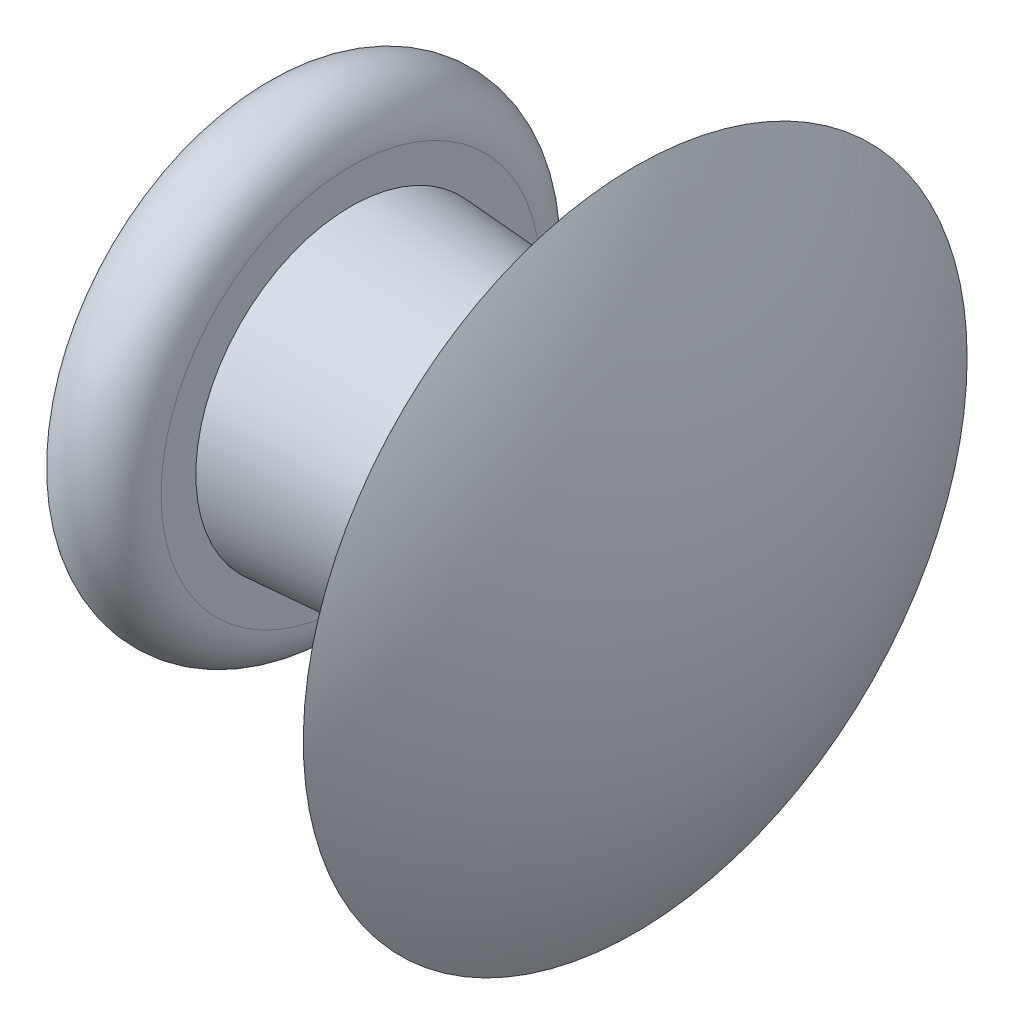
ISO-10303-21;
HEADER;
FILE_DESCRIPTION(('STEP AP214'),'2;1');
FILE_NAME('part.step','',(''),(''),'','','');
FILE_SCHEMA(('AUTOMOTIVE_DESIGN { 1 0 10303 214 1 1 1 1 }'));
ENDSEC;
DATA;
#1=APPLICATION_CONTEXT('core data for automotive mechanical design processes');
#2=APPLICATION_PROTOCOL_DEFINITION('international standard','automotive_design',2000,#1);
#3=PRODUCT_CONTEXT('',#1,'mechanical');
#4=PRODUCT('Part','Part','',(#3));
#5=PRODUCT_RELATED_PRODUCT_CATEGORY('part','',(#4));
#6=PRODUCT_DEFINITION_FORMATION('','',#4);
#7=PRODUCT_DEFINITION_CONTEXT('part definition',#1,'design');
#8=PRODUCT_DEFINITION('design','',#6,#7);
#9=PRODUCT_DEFINITION_SHAPE('','',#8);
#10=(LENGTH_UNIT() NAMED_UNIT(*) SI_UNIT(.MILLI.,.METRE.));
#11=(NAMED_UNIT(*) PLANE_ANGLE_UNIT() SI_UNIT($,.RADIAN.));
#12=(NAMED_UNIT(*) SI_UNIT($,.STERADIAN.) SOLID_ANGLE_UNIT());
#13=UNCERTAINTY_MEASURE_WITH_UNIT(LENGTH_MEASURE(1.E-05),#10,'distance_accuracy_value','');
#14=(GEOMETRIC_REPRESENTATION_CONTEXT(3) GLOBAL_UNCERTAINTY_ASSIGNED_CONTEXT((#13)) GLOBAL_UNIT_ASSIGNED_CONTEXT((#10,
#11,#12)) REPRESENTATION_CONTEXT('',''));
#15=CARTESIAN_POINT('',(0.,0.,0.));
#16=DIRECTION('',(0.,0.,1.));
#17=DIRECTION('',(1.,0.,0.));
#18=AXIS2_PLACEMENT_3D('',#15,#16,#17);
#19=CARTESIAN_POINT('',(-34.9312498546822,17.8018444279578,11.6152978002608));
#20=DIRECTION('',(-1.,0.,0.));
#21=DIRECTION('',(0.,0.,1.));
#22=AXIS2_PLACEMENT_3D('',#19,#20,#21);
#23=CONICAL_SURFACE('',#22,1.5,0.0665681637758237);
#24=CARTESIAN_POINT('',(-34.9312498546822,17.8018444279578,11.6152978002608));
#25=DIRECTION('',(1.,0.,0.));
#26=DIRECTION('',(0.,0.,-1.));
#27=AXIS2_PLACEMENT_3D('',#24,#25,#26);
#28=CIRCLE('',#27,1.5);
#29=CARTESIAN_POINT('',(-34.9312498546822,17.8018444279578,10.1152978002608));
#30=VERTEX_POINT('',#29);
#31=EDGE_CURVE('E10',#30,#30,#28,.T.);
#32=ORIENTED_EDGE('',*,*,#31,.F.);
#33=EDGE_LOOP('',(#32));
#34=FACE_BOUND('',#33,.T.);
#35=CARTESIAN_POINT('',(-36.9312498546822,17.8018444279578,11.6152978002608));
#36=DIRECTION('',(1.,0.,0.));
#37=DIRECTION('',(0.,0.,-1.));
#38=AXIS2_PLACEMENT_3D('',#35,#36,#37);
#39=CIRCLE('',#38,1.63333333333333);
#40=CARTESIAN_POINT('',(-36.9312498546822,17.8018444279578,9.98196446692746));
#41=VERTEX_POINT('',#40);
#42=EDGE_CURVE('E44',#41,#41,#39,.F.);
#43=ORIENTED_EDGE('',*,*,#42,.F.);
#44=EDGE_LOOP('',(#43));
#45=FACE_BOUND('',#44,.T.);
#46=ADVANCED_FACE('F34',(#34,#45),#23,.T.);
#47=CARTESIAN_POINT('',(-33.9312498546822,17.8018444279578,11.6152978002608));
#48=DIRECTION('',(1.,0.,0.));
#49=DIRECTION('',(0.,0.,-1.));
#50=AXIS2_PLACEMENT_3D('',#47,#48,#49);
#51=CONICAL_SURFACE('',#50,3.5,1.10714871779409);
#52=ORIENTED_EDGE('',*,*,#31,.T.);
#53=EDGE_LOOP('',(#52));
#54=FACE_BOUND('',#53,.T.);
#55=CARTESIAN_POINT('',(-33.9312498546822,17.8018444279578,11.6152978002608));
#56=DIRECTION('',(1.,0.,0.));
#57=DIRECTION('',(0.,0.,-1.));
#58=AXIS2_PLACEMENT_3D('',#55,#56,#57);
#59=CIRCLE('',#58,3.5);
#60=CARTESIAN_POINT('',(-33.9312498546822,17.8018444279578,8.11529780026079));
#61=VERTEX_POINT('',#60);
#62=EDGE_CURVE('E40',#61,#61,#59,.T.);
#63=ORIENTED_EDGE('',*,*,#62,.F.);
#64=EDGE_LOOP('',(#63));
#65=FACE_BOUND('',#64,.T.);
#66=ADVANCED_FACE('F69',(#54,#65),#51,.T.);
#67=CARTESIAN_POINT('',(-39.5562498546822,17.8018444279578,11.6152978002608));
#68=DIRECTION('',(1.,0.,0.));
#69=DIRECTION('',(0.,1.,0.));
#70=AXIS2_PLACEMENT_3D('',#67,#68,#69);
#71=SPHERICAL_SURFACE('',#70,6.625);
#72=ORIENTED_EDGE('',*,*,#62,.T.);
#73=EDGE_LOOP('',(#72));
#74=FACE_BOUND('',#73,.T.);
#75=ADVANCED_FACE('F76',(#74),#71,.T.);
#76=CARTESIAN_POINT('',(-36.9312498546822,17.8018444279578,11.6152978002608));
#77=DIRECTION('',(1.,0.,0.));
#78=DIRECTION('',(0.,0.,-1.));
#79=AXIS2_PLACEMENT_3D('',#76,#77,#78);
#80=PLANE('',#79);
#81=ORIENTED_EDGE('',*,*,#42,.T.);
#82=EDGE_LOOP('',(#81));
#83=FACE_BOUND('',#82,.T.);
#84=CARTESIAN_POINT('',(-36.9312498546822,17.8018444279578,11.6152978002608));
#85=DIRECTION('',(1.,0.,0.));
#86=DIRECTION('',(0.,0.,-1.));
#87=AXIS2_PLACEMENT_3D('',#84,#85,#86);
#88=CIRCLE('',#87,2.);
#89=CARTESIAN_POINT('',(-36.9312498546822,17.8018444279578,9.61529780026079));
#90=VERTEX_POINT('',#89);
#91=EDGE_CURVE('E48',#90,#90,#88,.T.);
#92=ORIENTED_EDGE('',*,*,#91,.T.);
#93=EDGE_LOOP('',(#92));
#94=FACE_BOUND('',#93,.T.);
#95=ADVANCED_FACE('F66',(#83,#94),#80,.T.);
#96=CARTESIAN_POINT('',(-37.4312498546822,17.8018444279578,11.6152978002608));
#97=DIRECTION('',(1.,0.,0.));
#98=DIRECTION('',(0.,0.,-1.));
#99=AXIS2_PLACEMENT_3D('',#96,#97,#98);
#100=TOROIDAL_SURFACE('',#99,2.,0.5);
#101=CARTESIAN_POINT('',(-37.9312498546822,17.8018444279578,11.6152978002608));
#102=DIRECTION('',(1.,0.,0.));
#103=DIRECTION('',(0.,0.,-1.));
#104=AXIS2_PLACEMENT_3D('',#101,#102,#103);
#105=CIRCLE('',#104,2.);
#106=CARTESIAN_POINT('',(-37.9312498546822,17.8018444279578,9.61529780026079));
#107=VERTEX_POINT('',#106);
#108=EDGE_CURVE('E53',#107,#107,#105,.T.);
#109=ORIENTED_EDGE('',*,*,#108,.T.);
#110=EDGE_LOOP('',(#109));
#111=FACE_BOUND('',#110,.T.);
#112=ORIENTED_EDGE('',*,*,#91,.F.);
#113=EDGE_LOOP('',(#112));
#114=FACE_BOUND('',#113,.T.);
#115=ADVANCED_FACE('F57',(#111,#114),#100,.T.);
#116=CARTESIAN_POINT('',(-37.9312498546822,19.8018444279578,11.6152978002608));
#117=DIRECTION('',(-1.,0.,0.));
#118=DIRECTION('',(0.,0.,1.));
#119=AXIS2_PLACEMENT_3D('',#116,#117,#118);
#120=PLANE('',#119);
#121=ORIENTED_EDGE('',*,*,#108,.F.);
#122=EDGE_LOOP('',(#121));
#123=FACE_BOUND('',#122,.T.);
#124=ADVANCED_FACE('F60',(#123),#120,.T.);
#125=CLOSED_SHELL('',(#46,#66,#75,#95,#115,#124));
#126=MANIFOLD_SOLID_BREP('B2',#125);
#127=ADVANCED_BREP_SHAPE_REPRESENTATION('',(#18,#126),#14);
#128=SHAPE_DEFINITION_REPRESENTATION(#9,#127);
ENDSEC;
END-ISO-10303-21;
